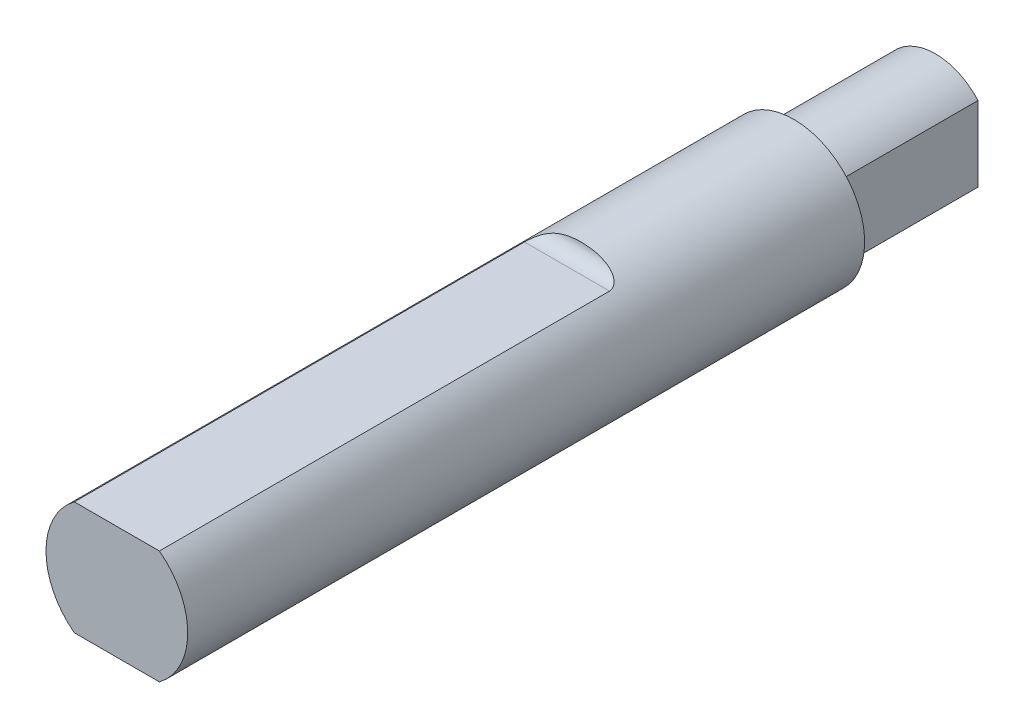
ISO-10303-21;
HEADER;
FILE_DESCRIPTION(('STEP AP214'),'2;1');
FILE_NAME('part.step','',(''),(''),'','','');
FILE_SCHEMA(('AUTOMOTIVE_DESIGN { 1 0 10303 214 1 1 1 1 }'));
ENDSEC;
DATA;
#1=APPLICATION_CONTEXT('core data for automotive mechanical design processes');
#2=APPLICATION_PROTOCOL_DEFINITION('international standard','automotive_design',2000,#1);
#3=PRODUCT_CONTEXT('',#1,'mechanical');
#4=PRODUCT('Part','Part','',(#3));
#5=PRODUCT_RELATED_PRODUCT_CATEGORY('part','',(#4));
#6=PRODUCT_DEFINITION_FORMATION('','',#4);
#7=PRODUCT_DEFINITION_CONTEXT('part definition',#1,'design');
#8=PRODUCT_DEFINITION('design','',#6,#7);
#9=PRODUCT_DEFINITION_SHAPE('','',#8);
#10=(LENGTH_UNIT() NAMED_UNIT(*) SI_UNIT(.MILLI.,.METRE.));
#11=(NAMED_UNIT(*) PLANE_ANGLE_UNIT() SI_UNIT($,.RADIAN.));
#12=(NAMED_UNIT(*) SI_UNIT($,.STERADIAN.) SOLID_ANGLE_UNIT());
#13=UNCERTAINTY_MEASURE_WITH_UNIT(LENGTH_MEASURE(1.E-05),#10,'distance_accuracy_value','');
#14=(GEOMETRIC_REPRESENTATION_CONTEXT(3) GLOBAL_UNCERTAINTY_ASSIGNED_CONTEXT((#13)) GLOBAL_UNIT_ASSIGNED_CONTEXT((#10,
#11,#12)) REPRESENTATION_CONTEXT('',''));
#15=CARTESIAN_POINT('',(0.,0.,0.));
#16=DIRECTION('',(0.,0.,1.));
#17=DIRECTION('',(1.,0.,0.));
#18=AXIS2_PLACEMENT_3D('',#15,#16,#17);
#19=CARTESIAN_POINT('',(0.,0.,28.879));
#20=DIRECTION('',(0.,0.,-1.));
#21=DIRECTION('',(-1.,0.,0.));
#22=AXIS2_PLACEMENT_3D('',#19,#20,#21);
#23=CYLINDRICAL_SURFACE('',#22,2.5);
#24=DIRECTION('',(0.,0.,1.));
#25=VECTOR('',#24,1.);
#26=CARTESIAN_POINT('',(-1.5,2.,13.));
#27=LINE('',#26,#25);
#28=CARTESIAN_POINT('',(-1.5,2.,13.));
#29=VERTEX_POINT('',#28);
#30=CARTESIAN_POINT('',(-1.5,2.,28.879));
#31=VERTEX_POINT('',#30);
#32=EDGE_CURVE('E59',#29,#31,#27,.T.);
#33=ORIENTED_EDGE('',*,*,#32,.F.);
#34=CARTESIAN_POINT('',(-1.5,2.,13.));
#35=CARTESIAN_POINT('',(-1.50003764789676,1.99996204260842,12.9801270939918));
#36=CARTESIAN_POINT('',(-1.49842384435408,2.00118246531402,12.9603121678149));
#37=CARTESIAN_POINT('',(-1.49222650560307,2.00581270427297,12.9216130488765));
#38=CARTESIAN_POINT('',(-1.48767283056031,2.00920050346558,12.9027215300121));
#39=CARTESIAN_POINT('',(-1.47593572021465,2.01783617161018,12.866318845422));
#40=CARTESIAN_POINT('',(-1.46876053417294,2.02307820410837,12.8488035568533));
#41=CARTESIAN_POINT('',(-1.45219399215916,2.03500319732235,12.8153551798525));
#42=CARTESIAN_POINT('',(-1.44279713865559,2.04168972886228,12.7994261578861));
#43=CARTESIAN_POINT('',(-1.41781987066032,2.05915123933595,12.7628936731018));
#44=CARTESIAN_POINT('',(-1.40130908276452,2.07045575891846,12.7431823898567));
#45=CARTESIAN_POINT('',(-1.36562651076482,2.09416516504227,12.7071433388162));
#46=CARTESIAN_POINT('',(-1.34644955520267,2.10657217273916,12.6908223042075));
#47=CARTESIAN_POINT('',(-1.29422204293538,2.13925428967746,12.6523992900839));
#48=CARTESIAN_POINT('',(-1.25968293240487,2.15983618200008,12.6326007286691));
#49=CARTESIAN_POINT('',(-1.18753543304728,2.20033839558917,12.5988789861883));
#50=CARTESIAN_POINT('',(-1.1499202794411,2.22025711538361,12.5849691940692));
#51=CARTESIAN_POINT('',(-1.0753576538674,2.25725860017117,12.5623802680839));
#52=CARTESIAN_POINT('',(-1.03854738167487,2.27444227625867,12.5534034154042));
#53=CARTESIAN_POINT('',(-0.963622358108705,2.30718585547751,12.538320756555));
#54=CARTESIAN_POINT('',(-0.925506516753103,2.32274435564197,12.532217415323));
#55=CARTESIAN_POINT('',(-0.848234331199594,2.35206509731221,12.5221340715266));
#56=CARTESIAN_POINT('',(-0.809075990847344,2.36582354201173,12.5181585041484));
#57=CARTESIAN_POINT('',(-0.730003692232962,2.39140608562468,12.511757712946));
#58=CARTESIAN_POINT('',(-0.690089500427328,2.40322957542402,12.5093329766199));
#59=CARTESIAN_POINT('',(-0.583695335636572,2.43187055653851,12.5043297945902));
#60=CARTESIAN_POINT('',(-0.516707751199012,2.44698125357976,12.5026635826573));
#61=CARTESIAN_POINT('',(-0.381680218624525,2.47164650838422,12.5006526372327));
#62=CARTESIAN_POINT('',(-0.313639732703513,2.48119812368875,12.5003086030396));
#63=CARTESIAN_POINT('',(-0.17689494788897,2.49468126945345,12.4999823404449));
#64=CARTESIAN_POINT('',(-0.108189784573381,2.49860407856408,12.5000006728511));
#65=CARTESIAN_POINT('',(0.0292885285896168,2.50077334188055,12.4999995207859));
#66=CARTESIAN_POINT('',(0.0980616517115612,2.49902150622101,12.4999800477085));
#67=CARTESIAN_POINT('',(0.236189368361699,2.48979370240751,12.500082500772));
#68=CARTESIAN_POINT('',(0.305538646297278,2.48223803844602,12.5002064078503));
#69=CARTESIAN_POINT('',(0.443413184509927,2.46135085579351,12.5013859651072));
#70=CARTESIAN_POINT('',(0.511937799208341,2.44801508060984,12.5024423025259));
#71=CARTESIAN_POINT('',(0.647193526035163,2.41577096481712,12.5068782516794));
#72=CARTESIAN_POINT('',(0.713932477602945,2.39689394184407,12.5102449452257));
#73=CARTESIAN_POINT('',(0.845235409225731,2.35378975438524,12.5213329551466));
#74=CARTESIAN_POINT('',(0.909803301209298,2.32957288093341,12.5290459391723));
#75=CARTESIAN_POINT('',(1.00689724559129,2.28856751254539,12.5466358174016));
#76=CARTESIAN_POINT('',(1.0405929543745,2.27343566004815,12.5539168780388));
#77=CARTESIAN_POINT('',(1.10672545283644,2.24198499092012,12.5713358115405));
#78=CARTESIAN_POINT('',(1.13916133991402,2.22566534650348,12.5814756911685));
#79=CARTESIAN_POINT('',(1.20248836052357,2.19210295314736,12.6055013814871));
#80=CARTESIAN_POINT('',(1.23336626785886,2.17485426056166,12.6194143902443));
#81=CARTESIAN_POINT('',(1.29249277747564,2.14023972682707,12.651954183292));
#82=CARTESIAN_POINT('',(1.3207460751502,2.12287415690563,12.6705723190686));
#83=CARTESIAN_POINT('',(1.36369129375408,2.09540988527656,12.7057121544341));
#84=CARTESIAN_POINT('',(1.37956695997829,2.08497392165533,12.7205152181738));
#85=CARTESIAN_POINT('',(1.4092206933471,2.06504576865738,12.7526703225722));
#86=CARTESIAN_POINT('',(1.42300046190452,2.05555281595633,12.7700202729831));
#87=CARTESIAN_POINT('',(1.44584560582323,2.03953294763964,12.8043731471273));
#88=CARTESIAN_POINT('',(1.45531182404525,2.03277437722238,12.8209982476329));
#89=CARTESIAN_POINT('',(1.47181688912402,2.02085578581294,12.8559164154415));
#90=CARTESIAN_POINT('',(1.47886172980617,2.01569182083874,12.8742052202788));
#91=CARTESIAN_POINT('',(1.48951213878094,2.00783355471162,12.9101519913855));
#92=CARTESIAN_POINT('',(1.49339609193229,2.00494045583067,12.9276826682146));
#93=CARTESIAN_POINT('',(1.49866389863576,2.00100224145652,12.9634586097079));
#94=CARTESIAN_POINT('',(1.50002727049885,1.99997226674316,12.9817085083218));
#95=CARTESIAN_POINT('',(1.5,2.,13.));
#96=B_SPLINE_CURVE_WITH_KNOTS('',3,(#34,#35,#36,#37,#38,#39,#40,#41,#42,#43,#44,#45,#46,#47,#48,
#49,#50,#51,#52,#53,#54,#55,#56,#57,#58,#59,#60,#61,#62,#63,#64,#65,#66,#67,#68,#69,#70,#71,#72,
#73,#74,#75,#76,#77,#78,#79,#80,#81,#82,#83,#84,#85,#86,#87,#88,#89,#90,#91,#92,#93,#94,#95),
.UNSPECIFIED.,.F.,.F.,(4,2,2,2,2,2,2,2,2,2,2,2,2,2,2,2,2,2,2,2,2,2,2,2,2,2,2,2,2,2,4),(0.,
0.0594240604100865,0.118253851146158,0.176900091122953,0.23569299919409,0.319483748208468,
0.4034393510802,0.537132622114271,0.671128252066823,0.795755173925104,0.920488808552728,
1.0454814384435,1.17051334001496,1.37630110705273,1.58219770008409,1.78841296891252,
1.99456609762953,2.20360178523935,2.41279166964386,2.62082131363629,2.82845349062704,
2.94128618701053,3.05419828496205,3.167946982397,3.28148809957397,3.35355280648448,
3.42555869666673,3.48619425822216,3.54667862420211,3.60096715275308,3.65569491121139),.UNSPECIFIED.);
#97=CARTESIAN_POINT('',(1.5,2.,13.));
#98=VERTEX_POINT('',#97);
#99=EDGE_CURVE('E102',#29,#98,#96,.T.);
#100=ORIENTED_EDGE('',*,*,#99,.T.);
#101=DIRECTION('',(0.,0.,1.));
#102=VECTOR('',#101,1.);
#103=CARTESIAN_POINT('',(1.5,2.,13.));
#104=LINE('',#103,#102);
#105=CARTESIAN_POINT('',(1.5,2.,28.879));
#106=VERTEX_POINT('',#105);
#107=EDGE_CURVE('E107',#98,#106,#104,.T.);
#108=ORIENTED_EDGE('',*,*,#107,.T.);
#109=CARTESIAN_POINT('',(0.,0.,28.879));
#110=DIRECTION('',(0.,0.,1.));
#111=DIRECTION('',(1.,0.,0.));
#112=AXIS2_PLACEMENT_3D('',#109,#110,#111);
#113=CIRCLE('',#112,2.5);
#114=CARTESIAN_POINT('',(1.5,-2.,28.879));
#115=VERTEX_POINT('',#114);
#116=EDGE_CURVE('E40',#115,#106,#113,.T.);
#117=ORIENTED_EDGE('',*,*,#116,.F.);
#118=DIRECTION('',(0.,0.,1.));
#119=VECTOR('',#118,1.);
#120=CARTESIAN_POINT('',(1.5,-2.,13.));
#121=LINE('',#120,#119);
#122=CARTESIAN_POINT('',(1.5,-2.,13.));
#123=VERTEX_POINT('',#122);
#124=EDGE_CURVE('E51',#123,#115,#121,.T.);
#125=ORIENTED_EDGE('',*,*,#124,.F.);
#126=CARTESIAN_POINT('',(1.5,-2.,13.));
#127=CARTESIAN_POINT('',(1.50003764789676,-1.99996204260842,12.9801270939918));
#128=CARTESIAN_POINT('',(1.49842384435408,-2.00118246531402,12.9603121678149));
#129=CARTESIAN_POINT('',(1.49222650560307,-2.00581270427297,12.9216130488765));
#130=CARTESIAN_POINT('',(1.48767283056031,-2.00920050346558,12.9027215300121));
#131=CARTESIAN_POINT('',(1.47593572021465,-2.01783617161018,12.866318845422));
#132=CARTESIAN_POINT('',(1.46876053417294,-2.02307820410837,12.8488035568533));
#133=CARTESIAN_POINT('',(1.45219399215916,-2.03500319732235,12.8153551798525));
#134=CARTESIAN_POINT('',(1.44279713865559,-2.04168972886228,12.7994261578861));
#135=CARTESIAN_POINT('',(1.41781987066032,-2.05915123933595,12.7628936731018));
#136=CARTESIAN_POINT('',(1.40130908276452,-2.07045575891846,12.7431823898567));
#137=CARTESIAN_POINT('',(1.36562651076482,-2.09416516504227,12.7071433388162));
#138=CARTESIAN_POINT('',(1.34644955520267,-2.10657217273916,12.6908223042075));
#139=CARTESIAN_POINT('',(1.29422204293538,-2.13925428967746,12.6523992900839));
#140=CARTESIAN_POINT('',(1.25968293240487,-2.15983618200008,12.6326007286691));
#141=CARTESIAN_POINT('',(1.18753543304728,-2.20033839558917,12.5988789861883));
#142=CARTESIAN_POINT('',(1.1499202794411,-2.22025711538361,12.5849691940692));
#143=CARTESIAN_POINT('',(1.0753576538674,-2.25725860017117,12.5623802680839));
#144=CARTESIAN_POINT('',(1.03854738167487,-2.27444227625867,12.5534034154042));
#145=CARTESIAN_POINT('',(0.963622358108705,-2.30718585547751,12.538320756555));
#146=CARTESIAN_POINT('',(0.925506516753103,-2.32274435564197,12.532217415323));
#147=CARTESIAN_POINT('',(0.848234331199594,-2.35206509731221,12.5221340715266));
#148=CARTESIAN_POINT('',(0.809075990847344,-2.36582354201173,12.5181585041484));
#149=CARTESIAN_POINT('',(0.730003692232962,-2.39140608562468,12.511757712946));
#150=CARTESIAN_POINT('',(0.690089500427328,-2.40322957542402,12.5093329766199));
#151=CARTESIAN_POINT('',(0.583695335636572,-2.43187055653851,12.5043297945902));
#152=CARTESIAN_POINT('',(0.516707751199012,-2.44698125357976,12.5026635826573));
#153=CARTESIAN_POINT('',(0.381680218624525,-2.47164650838422,12.5006526372327));
#154=CARTESIAN_POINT('',(0.313639732703513,-2.48119812368875,12.5003086030396));
#155=CARTESIAN_POINT('',(0.17689494788897,-2.49468126945345,12.4999823404449));
#156=CARTESIAN_POINT('',(0.108189784573381,-2.49860407856408,12.5000006728511));
#157=CARTESIAN_POINT('',(-0.0292885285896168,-2.50077334188055,12.4999995207859));
#158=CARTESIAN_POINT('',(-0.0980616517115612,-2.49902150622101,12.4999800477085));
#159=CARTESIAN_POINT('',(-0.236189368361699,-2.48979370240751,12.500082500772));
#160=CARTESIAN_POINT('',(-0.305538646297278,-2.48223803844602,12.5002064078503));
#161=CARTESIAN_POINT('',(-0.443413184509927,-2.46135085579351,12.5013859651072));
#162=CARTESIAN_POINT('',(-0.511937799208341,-2.44801508060984,12.5024423025259));
#163=CARTESIAN_POINT('',(-0.647193526035163,-2.41577096481712,12.5068782516794));
#164=CARTESIAN_POINT('',(-0.713932477602945,-2.39689394184407,12.5102449452257));
#165=CARTESIAN_POINT('',(-0.845235409225731,-2.35378975438524,12.5213329551466));
#166=CARTESIAN_POINT('',(-0.909803301209298,-2.32957288093341,12.5290459391723));
#167=CARTESIAN_POINT('',(-1.00689724559129,-2.28856751254539,12.5466358174016));
#168=CARTESIAN_POINT('',(-1.0405929543745,-2.27343566004815,12.5539168780388));
#169=CARTESIAN_POINT('',(-1.10672545283644,-2.24198499092012,12.5713358115405));
#170=CARTESIAN_POINT('',(-1.13916133991402,-2.22566534650348,12.5814756911685));
#171=CARTESIAN_POINT('',(-1.20248836052357,-2.19210295314736,12.6055013814871));
#172=CARTESIAN_POINT('',(-1.23336626785886,-2.17485426056166,12.6194143902443));
#173=CARTESIAN_POINT('',(-1.29249277747564,-2.14023972682707,12.651954183292));
#174=CARTESIAN_POINT('',(-1.3207460751502,-2.12287415690563,12.6705723190686));
#175=CARTESIAN_POINT('',(-1.36369129375408,-2.09540988527656,12.7057121544341));
#176=CARTESIAN_POINT('',(-1.37956695997829,-2.08497392165533,12.7205152181738));
#177=CARTESIAN_POINT('',(-1.4092206933471,-2.06504576865738,12.7526703225722));
#178=CARTESIAN_POINT('',(-1.42300046190452,-2.05555281595633,12.7700202729831));
#179=CARTESIAN_POINT('',(-1.44584560582323,-2.03953294763964,12.8043731471273));
#180=CARTESIAN_POINT('',(-1.45531182404525,-2.03277437722238,12.8209982476329));
#181=CARTESIAN_POINT('',(-1.47181688912402,-2.02085578581294,12.8559164154415));
#182=CARTESIAN_POINT('',(-1.47886172980617,-2.01569182083874,12.8742052202788));
#183=CARTESIAN_POINT('',(-1.48951213878094,-2.00783355471162,12.9101519913855));
#184=CARTESIAN_POINT('',(-1.49339609193229,-2.00494045583067,12.9276826682146));
#185=CARTESIAN_POINT('',(-1.49866389863576,-2.00100224145652,12.9634586097079));
#186=CARTESIAN_POINT('',(-1.50002727049885,-1.99997226674316,12.9817085083218));
#187=CARTESIAN_POINT('',(-1.5,-2.,13.));
#188=B_SPLINE_CURVE_WITH_KNOTS('',3,(#126,#127,#128,#129,#130,#131,#132,#133,#134,#135,#136,
#137,#138,#139,#140,#141,#142,#143,#144,#145,#146,#147,#148,#149,#150,#151,#152,#153,#154,#155,
#156,#157,#158,#159,#160,#161,#162,#163,#164,#165,#166,#167,#168,#169,#170,#171,#172,#173,#174,
#175,#176,#177,#178,#179,#180,#181,#182,#183,#184,#185,#186,#187),.UNSPECIFIED.,.F.,.F.,(4,2,2,
2,2,2,2,2,2,2,2,2,2,2,2,2,2,2,2,2,2,2,2,2,2,2,2,2,2,2,4),(0.,0.0594240604100865,
0.118253851146158,0.176900091122953,0.23569299919409,0.319483748208468,0.4034393510802,
0.537132622114271,0.671128252066823,0.795755173925104,0.920488808552728,1.0454814384435,
1.17051334001496,1.37630110705273,1.58219770008409,1.78841296891252,1.99456609762953,
2.20360178523935,2.41279166964386,2.62082131363629,2.82845349062704,2.94128618701053,
3.05419828496205,3.167946982397,3.28148809957397,3.35355280648448,3.42555869666673,
3.48619425822216,3.54667862420211,3.60096715275308,3.65569491121139),.UNSPECIFIED.);
#189=CARTESIAN_POINT('',(-1.5,-2.,13.));
#190=VERTEX_POINT('',#189);
#191=EDGE_CURVE('E111',#123,#190,#188,.T.);
#192=ORIENTED_EDGE('',*,*,#191,.T.);
#193=DIRECTION('',(0.,0.,1.));
#194=VECTOR('',#193,1.);
#195=CARTESIAN_POINT('',(-1.5,-2.,13.));
#196=LINE('',#195,#194);
#197=CARTESIAN_POINT('',(-1.5,-2.,28.879));
#198=VERTEX_POINT('',#197);
#199=EDGE_CURVE('E128',#190,#198,#196,.T.);
#200=ORIENTED_EDGE('',*,*,#199,.T.);
#201=EDGE_CURVE('E11',#31,#198,#113,.T.);
#202=ORIENTED_EDGE('',*,*,#201,.F.);
#203=EDGE_LOOP('',(#33,#100,#108,#117,#125,#192,#200,#202));
#204=FACE_BOUND('',#203,.T.);
#205=CARTESIAN_POINT('',(0.,0.,5.));
#206=DIRECTION('',(0.,0.,-1.));
#207=DIRECTION('',(-1.,0.,0.));
#208=AXIS2_PLACEMENT_3D('',#205,#206,#207);
#209=CIRCLE('',#208,2.5);
#210=CARTESIAN_POINT('',(-2.5,0.,5.));
#211=VERTEX_POINT('',#210);
#212=EDGE_CURVE('E158',#211,#211,#209,.T.);
#213=ORIENTED_EDGE('',*,*,#212,.F.);
#214=EDGE_LOOP('',(#213));
#215=FACE_BOUND('',#214,.T.);
#216=ADVANCED_FACE('F36',(#204,#215),#23,.T.);
#217=CARTESIAN_POINT('',(0.,0.,28.879));
#218=DIRECTION('',(0.,0.,1.));
#219=DIRECTION('',(1.,0.,0.));
#220=AXIS2_PLACEMENT_3D('',#217,#218,#219);
#221=PLANE('',#220);
#222=DIRECTION('',(1.,0.,0.));
#223=VECTOR('',#222,1.);
#224=CARTESIAN_POINT('',(-1.5,2.,28.879));
#225=LINE('',#224,#223);
#226=EDGE_CURVE('E115',#31,#106,#225,.T.);
#227=ORIENTED_EDGE('',*,*,#226,.F.);
#228=ORIENTED_EDGE('',*,*,#201,.T.);
#229=DIRECTION('',(-1.,0.,0.));
#230=VECTOR('',#229,1.);
#231=CARTESIAN_POINT('',(-1.5,-2.,28.879));
#232=LINE('',#231,#230);
#233=EDGE_CURVE('E131',#115,#198,#232,.T.);
#234=ORIENTED_EDGE('',*,*,#233,.F.);
#235=ORIENTED_EDGE('',*,*,#116,.T.);
#236=EDGE_LOOP('',(#227,#228,#234,#235));
#237=FACE_BOUND('',#236,.T.);
#238=ADVANCED_FACE('F168',(#237),#221,.T.);
#239=CARTESIAN_POINT('',(0.,0.,5.));
#240=DIRECTION('',(0.,0.,-1.));
#241=DIRECTION('',(-1.,0.,0.));
#242=AXIS2_PLACEMENT_3D('',#239,#240,#241);
#243=PLANE('',#242);
#244=DIRECTION('',(0.,1.,0.));
#245=VECTOR('',#244,1.);
#246=CARTESIAN_POINT('',(-1.5,-1.3228756555323,5.));
#247=LINE('',#246,#245);
#248=CARTESIAN_POINT('',(-1.5,-1.32287565553229,5.));
#249=VERTEX_POINT('',#248);
#250=CARTESIAN_POINT('',(-1.5,1.3228756555323,5.));
#251=VERTEX_POINT('',#250);
#252=EDGE_CURVE('E145',#249,#251,#247,.T.);
#253=ORIENTED_EDGE('',*,*,#252,.F.);
#254=CARTESIAN_POINT('',(0.,0.,5.));
#255=DIRECTION('',(0.,0.,-1.));
#256=DIRECTION('',(-1.,0.,0.));
#257=AXIS2_PLACEMENT_3D('',#254,#255,#256);
#258=CIRCLE('',#257,2.);
#259=CARTESIAN_POINT('',(1.5,-1.32287565553229,5.));
#260=VERTEX_POINT('',#259);
#261=EDGE_CURVE('E142',#260,#249,#258,.T.);
#262=ORIENTED_EDGE('',*,*,#261,.F.);
#263=DIRECTION('',(0.,-1.,0.));
#264=VECTOR('',#263,1.);
#265=CARTESIAN_POINT('',(1.5,1.32287565553229,5.));
#266=LINE('',#265,#264);
#267=CARTESIAN_POINT('',(1.5,1.32287565553229,5.));
#268=VERTEX_POINT('',#267);
#269=EDGE_CURVE('E138',#268,#260,#266,.T.);
#270=ORIENTED_EDGE('',*,*,#269,.F.);
#271=CARTESIAN_POINT('',(0.,0.,5.));
#272=DIRECTION('',(0.,0.,-1.));
#273=DIRECTION('',(1.,0.,0.));
#274=AXIS2_PLACEMENT_3D('',#271,#272,#273);
#275=CIRCLE('',#274,2.);
#276=EDGE_CURVE('E135',#251,#268,#275,.T.);
#277=ORIENTED_EDGE('',*,*,#276,.F.);
#278=EDGE_LOOP('',(#253,#262,#270,#277));
#279=FACE_BOUND('',#278,.T.);
#280=ORIENTED_EDGE('',*,*,#212,.T.);
#281=EDGE_LOOP('',(#280));
#282=FACE_BOUND('',#281,.T.);
#283=ADVANCED_FACE('F189',(#279,#282),#243,.T.);
#284=CARTESIAN_POINT('',(0.,0.,5.));
#285=DIRECTION('',(0.,0.,-1.));
#286=DIRECTION('',(-1.,0.,0.));
#287=AXIS2_PLACEMENT_3D('',#284,#285,#286);
#288=CYLINDRICAL_SURFACE('',#287,2.);
#289=CARTESIAN_POINT('',(0.,0.,0.));
#290=DIRECTION('',(0.,0.,-1.));
#291=DIRECTION('',(1.,0.,0.));
#292=AXIS2_PLACEMENT_3D('',#289,#290,#291);
#293=CIRCLE('',#292,2.);
#294=CARTESIAN_POINT('',(-1.5,1.3228756555323,0.));
#295=VERTEX_POINT('',#294);
#296=CARTESIAN_POINT('',(1.5,1.32287565553229,0.));
#297=VERTEX_POINT('',#296);
#298=EDGE_CURVE('E118',#295,#297,#293,.T.);
#299=ORIENTED_EDGE('',*,*,#298,.F.);
#300=DIRECTION('',(0.,0.,-1.));
#301=VECTOR('',#300,1.);
#302=CARTESIAN_POINT('',(-1.5,1.3228756555323,5.));
#303=LINE('',#302,#301);
#304=EDGE_CURVE('E156',#251,#295,#303,.T.);
#305=ORIENTED_EDGE('',*,*,#304,.F.);
#306=ORIENTED_EDGE('',*,*,#276,.T.);
#307=DIRECTION('',(0.,0.,-1.));
#308=VECTOR('',#307,1.);
#309=CARTESIAN_POINT('',(1.5,1.32287565553229,5.));
#310=LINE('',#309,#308);
#311=EDGE_CURVE('E147',#268,#297,#310,.T.);
#312=ORIENTED_EDGE('',*,*,#311,.T.);
#313=EDGE_LOOP('',(#299,#305,#306,#312));
#314=FACE_BOUND('',#313,.T.);
#315=ADVANCED_FACE('F194',(#314),#288,.T.);
#316=CARTESIAN_POINT('',(-1.5,-1.3228756555323,5.));
#317=DIRECTION('',(-1.,0.,0.));
#318=DIRECTION('',(0.,0.,1.));
#319=AXIS2_PLACEMENT_3D('',#316,#317,#318);
#320=PLANE('',#319);
#321=DIRECTION('',(0.,1.,0.));
#322=VECTOR('',#321,1.);
#323=CARTESIAN_POINT('',(-1.5,-1.3228756555323,0.));
#324=LINE('',#323,#322);
#325=CARTESIAN_POINT('',(-1.5,-1.32287565553229,0.));
#326=VERTEX_POINT('',#325);
#327=EDGE_CURVE('E139',#326,#295,#324,.T.);
#328=ORIENTED_EDGE('',*,*,#327,.F.);
#329=DIRECTION('',(0.,0.,-1.));
#330=VECTOR('',#329,1.);
#331=CARTESIAN_POINT('',(-1.5,-1.32287565553229,5.));
#332=LINE('',#331,#330);
#333=EDGE_CURVE('E159',#249,#326,#332,.T.);
#334=ORIENTED_EDGE('',*,*,#333,.F.);
#335=ORIENTED_EDGE('',*,*,#252,.T.);
#336=ORIENTED_EDGE('',*,*,#304,.T.);
#337=EDGE_LOOP('',(#328,#334,#335,#336));
#338=FACE_BOUND('',#337,.T.);
#339=ADVANCED_FACE('F200',(#338),#320,.T.);
#340=CARTESIAN_POINT('',(0.,0.,5.));
#341=DIRECTION('',(0.,0.,-1.));
#342=DIRECTION('',(-1.,0.,0.));
#343=AXIS2_PLACEMENT_3D('',#340,#341,#342);
#344=CYLINDRICAL_SURFACE('',#343,2.);
#345=CARTESIAN_POINT('',(0.,0.,0.));
#346=DIRECTION('',(0.,0.,-1.));
#347=DIRECTION('',(-1.,0.,0.));
#348=AXIS2_PLACEMENT_3D('',#345,#346,#347);
#349=CIRCLE('',#348,2.);
#350=CARTESIAN_POINT('',(1.5,-1.32287565553229,0.));
#351=VERTEX_POINT('',#350);
#352=EDGE_CURVE('E151',#351,#326,#349,.T.);
#353=ORIENTED_EDGE('',*,*,#352,.F.);
#354=DIRECTION('',(0.,0.,-1.));
#355=VECTOR('',#354,1.);
#356=CARTESIAN_POINT('',(1.5,-1.32287565553229,5.));
#357=LINE('',#356,#355);
#358=EDGE_CURVE('E161',#260,#351,#357,.T.);
#359=ORIENTED_EDGE('',*,*,#358,.F.);
#360=ORIENTED_EDGE('',*,*,#261,.T.);
#361=ORIENTED_EDGE('',*,*,#333,.T.);
#362=EDGE_LOOP('',(#353,#359,#360,#361));
#363=FACE_BOUND('',#362,.T.);
#364=ADVANCED_FACE('F204',(#363),#344,.T.);
#365=CARTESIAN_POINT('',(1.5,1.32287565553229,5.));
#366=DIRECTION('',(1.,0.,0.));
#367=DIRECTION('',(0.,0.,-1.));
#368=AXIS2_PLACEMENT_3D('',#365,#366,#367);
#369=PLANE('',#368);
#370=DIRECTION('',(0.,-1.,0.));
#371=VECTOR('',#370,1.);
#372=CARTESIAN_POINT('',(1.5,1.32287565553229,0.));
#373=LINE('',#372,#371);
#374=EDGE_CURVE('E121',#297,#351,#373,.T.);
#375=ORIENTED_EDGE('',*,*,#374,.F.);
#376=ORIENTED_EDGE('',*,*,#311,.F.);
#377=ORIENTED_EDGE('',*,*,#269,.T.);
#378=ORIENTED_EDGE('',*,*,#358,.T.);
#379=EDGE_LOOP('',(#375,#376,#377,#378));
#380=FACE_BOUND('',#379,.T.);
#381=ADVANCED_FACE('F182',(#380),#369,.T.);
#382=CARTESIAN_POINT('',(0.,0.,0.));
#383=DIRECTION('',(0.,0.,1.));
#384=DIRECTION('',(1.,0.,0.));
#385=AXIS2_PLACEMENT_3D('',#382,#383,#384);
#386=PLANE('',#385);
#387=ORIENTED_EDGE('',*,*,#298,.T.);
#388=ORIENTED_EDGE('',*,*,#374,.T.);
#389=ORIENTED_EDGE('',*,*,#352,.T.);
#390=ORIENTED_EDGE('',*,*,#327,.T.);
#391=EDGE_LOOP('',(#387,#388,#389,#390));
#392=FACE_BOUND('',#391,.T.);
#393=ADVANCED_FACE('F175',(#392),#386,.F.);
#394=CARTESIAN_POINT('',(-1.5,-2.,13.));
#395=DIRECTION('',(0.,1.,0.));
#396=DIRECTION('',(0.,0.,1.));
#397=AXIS2_PLACEMENT_3D('',#394,#395,#396);
#398=PLANE('',#397);
#399=ORIENTED_EDGE('',*,*,#233,.T.);
#400=ORIENTED_EDGE('',*,*,#199,.F.);
#401=DIRECTION('',(-1.,0.,0.));
#402=VECTOR('',#401,1.);
#403=CARTESIAN_POINT('',(-1.5,-2.,13.));
#404=LINE('',#403,#402);
#405=EDGE_CURVE('E127',#123,#190,#404,.T.);
#406=ORIENTED_EDGE('',*,*,#405,.F.);
#407=ORIENTED_EDGE('',*,*,#124,.T.);
#408=EDGE_LOOP('',(#399,#400,#406,#407));
#409=FACE_BOUND('',#408,.T.);
#410=ADVANCED_FACE('F173',(#409),#398,.F.);
#411=CARTESIAN_POINT('',(-1.5,2.,13.));
#412=DIRECTION('',(0.,-1.,0.));
#413=DIRECTION('',(0.,0.,-1.));
#414=AXIS2_PLACEMENT_3D('',#411,#412,#413);
#415=PLANE('',#414);
#416=ORIENTED_EDGE('',*,*,#226,.T.);
#417=ORIENTED_EDGE('',*,*,#107,.F.);
#418=DIRECTION('',(1.,0.,0.));
#419=VECTOR('',#418,1.);
#420=CARTESIAN_POINT('',(-1.5,2.,13.));
#421=LINE('',#420,#419);
#422=EDGE_CURVE('E113',#29,#98,#421,.T.);
#423=ORIENTED_EDGE('',*,*,#422,.F.);
#424=ORIENTED_EDGE('',*,*,#32,.T.);
#425=EDGE_LOOP('',(#416,#417,#423,#424));
#426=FACE_BOUND('',#425,.T.);
#427=ADVANCED_FACE('F117',(#426),#415,.F.);
#428=CARTESIAN_POINT('',(-2.5,2.5,13.));
#429=DIRECTION('',(1.,0.,0.));
#430=DIRECTION('',(0.,0.,-1.));
#431=AXIS2_PLACEMENT_3D('',#428,#429,#430);
#432=CYLINDRICAL_SURFACE('',#431,0.5);
#433=ORIENTED_EDGE('',*,*,#422,.T.);
#434=ORIENTED_EDGE('',*,*,#99,.F.);
#435=EDGE_LOOP('',(#433,#434));
#436=FACE_BOUND('',#435,.T.);
#437=ADVANCED_FACE('F114',(#436),#432,.F.);
#438=CARTESIAN_POINT('',(-2.5,-2.5,13.));
#439=DIRECTION('',(1.,0.,0.));
#440=DIRECTION('',(0.,0.,-1.));
#441=AXIS2_PLACEMENT_3D('',#438,#439,#440);
#442=CYLINDRICAL_SURFACE('',#441,0.5);
#443=ORIENTED_EDGE('',*,*,#405,.T.);
#444=ORIENTED_EDGE('',*,*,#191,.F.);
#445=EDGE_LOOP('',(#443,#444));
#446=FACE_BOUND('',#445,.T.);
#447=ADVANCED_FACE('F172',(#446),#442,.F.);
#448=CLOSED_SHELL('',(#216,#238,#283,#315,#339,#364,#381,#393,#410,#427,#437,#447));
#449=MANIFOLD_SOLID_BREP('B2',#448);
#450=ADVANCED_BREP_SHAPE_REPRESENTATION('',(#18,#449),#14);
#451=SHAPE_DEFINITION_REPRESENTATION(#9,#450);
ENDSEC;
END-ISO-10303-21;
